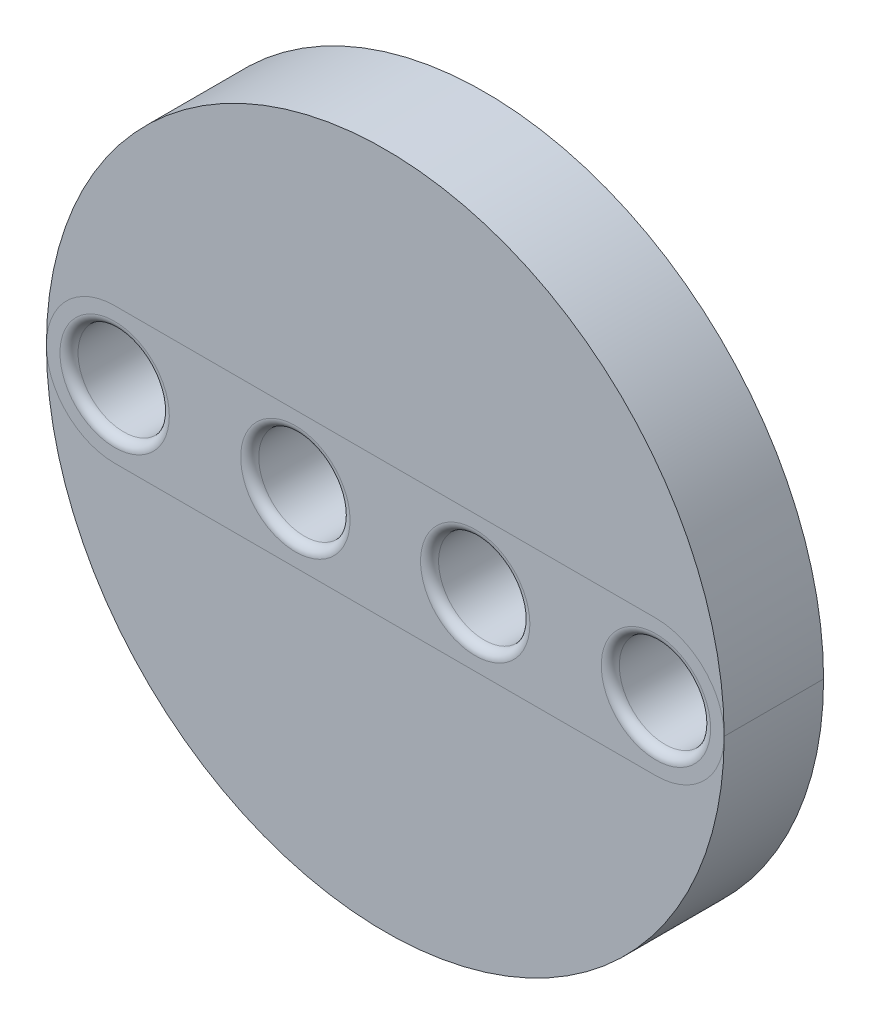
ISO-10303-21;
HEADER;
FILE_DESCRIPTION(('STEP AP214'),'2;1');
FILE_NAME('part.step','',(''),(''),'','','');
FILE_SCHEMA(('AUTOMOTIVE_DESIGN { 1 0 10303 214 1 1 1 1 }'));
ENDSEC;
DATA;
#1=APPLICATION_CONTEXT('core data for automotive mechanical design processes');
#2=APPLICATION_PROTOCOL_DEFINITION('international standard','automotive_design',2000,#1);
#3=PRODUCT_CONTEXT('',#1,'mechanical');
#4=PRODUCT('Part','Part','',(#3));
#5=PRODUCT_RELATED_PRODUCT_CATEGORY('part','',(#4));
#6=PRODUCT_DEFINITION_FORMATION('','',#4);
#7=PRODUCT_DEFINITION_CONTEXT('part definition',#1,'design');
#8=PRODUCT_DEFINITION('design','',#6,#7);
#9=PRODUCT_DEFINITION_SHAPE('','',#8);
#10=(LENGTH_UNIT() NAMED_UNIT(*) SI_UNIT(.MILLI.,.METRE.));
#11=(NAMED_UNIT(*) PLANE_ANGLE_UNIT() SI_UNIT($,.RADIAN.));
#12=(NAMED_UNIT(*) SI_UNIT($,.STERADIAN.) SOLID_ANGLE_UNIT());
#13=UNCERTAINTY_MEASURE_WITH_UNIT(LENGTH_MEASURE(1.E-05),#10,'distance_accuracy_value','');
#14=(GEOMETRIC_REPRESENTATION_CONTEXT(3) GLOBAL_UNCERTAINTY_ASSIGNED_CONTEXT((#13)) GLOBAL_UNIT_ASSIGNED_CONTEXT((#10,
#11,#12)) REPRESENTATION_CONTEXT('',''));
#15=CARTESIAN_POINT('',(0.,0.,0.));
#16=DIRECTION('',(0.,0.,1.));
#17=DIRECTION('',(1.,0.,0.));
#18=AXIS2_PLACEMENT_3D('',#15,#16,#17);
#19=CARTESIAN_POINT('',(59.9,0.,-83.8525491562421));
#20=DIRECTION('',(0.,0.,1.));
#21=DIRECTION('',(1.,0.,0.));
#22=AXIS2_PLACEMENT_3D('',#19,#20,#21);
#23=CYLINDRICAL_SURFACE('',#22,7.55);
#24=DIRECTION('',(0.,0.,1.));
#25=VECTOR('',#24,1.);
#26=CARTESIAN_POINT('',(59.9,7.55,-83.8525491562421));
#27=LINE('',#26,#25);
#28=CARTESIAN_POINT('',(59.9,7.55,0.));
#29=VERTEX_POINT('',#28);
#30=CARTESIAN_POINT('',(59.9,7.55,11.));
#31=VERTEX_POINT('',#30);
#32=EDGE_CURVE('E112',#29,#31,#27,.T.);
#33=ORIENTED_EDGE('',*,*,#32,.F.);
#34=CARTESIAN_POINT('',(59.9,0.,0.));
#35=DIRECTION('',(0.,0.,1.));
#36=DIRECTION('',(1.,0.,0.));
#37=AXIS2_PLACEMENT_3D('',#34,#35,#36);
#38=CIRCLE('',#37,7.55);
#39=CARTESIAN_POINT('',(67.45,0.,0.));
#40=VERTEX_POINT('',#39);
#41=EDGE_CURVE('E57',#29,#40,#38,.F.);
#42=ORIENTED_EDGE('',*,*,#41,.T.);
#43=DIRECTION('',(0.,0.,1.));
#44=VECTOR('',#43,1.);
#45=CARTESIAN_POINT('',(67.45,0.,-83.8525491562421));
#46=LINE('',#45,#44);
#47=CARTESIAN_POINT('',(67.45,0.,11.));
#48=VERTEX_POINT('',#47);
#49=EDGE_CURVE('E87',#40,#48,#46,.T.);
#50=ORIENTED_EDGE('',*,*,#49,.T.);
#51=CARTESIAN_POINT('',(59.9,0.,11.));
#52=DIRECTION('',(0.,0.,1.));
#53=DIRECTION('',(1.,0.,0.));
#54=AXIS2_PLACEMENT_3D('',#51,#52,#53);
#55=CIRCLE('',#54,7.55);
#56=EDGE_CURVE('E90',#48,#31,#55,.T.);
#57=ORIENTED_EDGE('',*,*,#56,.T.);
#58=EDGE_LOOP('',(#33,#42,#50,#57));
#59=FACE_BOUND('',#58,.T.);
#60=ADVANCED_FACE('F50',(#59),#23,.F.);
#61=CARTESIAN_POINT('',(0.,7.55,-83.8525491562421));
#62=DIRECTION('',(0.,1.,0.));
#63=DIRECTION('',(0.,0.,1.));
#64=AXIS2_PLACEMENT_3D('',#61,#62,#63);
#65=PLANE('',#64);
#66=DIRECTION('',(0.,0.,1.));
#67=VECTOR('',#66,1.);
#68=CARTESIAN_POINT('',(0.,7.55,-83.8525491562421));
#69=LINE('',#68,#67);
#70=CARTESIAN_POINT('',(0.,7.55,0.));
#71=VERTEX_POINT('',#70);
#72=CARTESIAN_POINT('',(0.,7.55,11.));
#73=VERTEX_POINT('',#72);
#74=EDGE_CURVE('E115',#71,#73,#69,.T.);
#75=ORIENTED_EDGE('',*,*,#74,.F.);
#76=DIRECTION('',(1.,0.,0.));
#77=VECTOR('',#76,1.);
#78=CARTESIAN_POINT('',(0.,7.55,0.));
#79=LINE('',#78,#77);
#80=EDGE_CURVE('E64',#71,#29,#79,.T.);
#81=ORIENTED_EDGE('',*,*,#80,.T.);
#82=ORIENTED_EDGE('',*,*,#32,.T.);
#83=DIRECTION('',(-1.,0.,0.));
#84=VECTOR('',#83,1.);
#85=CARTESIAN_POINT('',(0.,7.55,11.));
#86=LINE('',#85,#84);
#87=EDGE_CURVE('E94',#31,#73,#86,.T.);
#88=ORIENTED_EDGE('',*,*,#87,.T.);
#89=EDGE_LOOP('',(#75,#81,#82,#88));
#90=FACE_BOUND('',#89,.T.);
#91=ADVANCED_FACE('F121',(#90),#65,.F.);
#92=CARTESIAN_POINT('',(0.,0.,-83.8525491562421));
#93=DIRECTION('',(0.,0.,1.));
#94=DIRECTION('',(1.,0.,0.));
#95=AXIS2_PLACEMENT_3D('',#92,#93,#94);
#96=CYLINDRICAL_SURFACE('',#95,7.55);
#97=DIRECTION('',(0.,0.,1.));
#98=VECTOR('',#97,1.);
#99=CARTESIAN_POINT('',(-7.55,0.,-83.8525491562421));
#100=LINE('',#99,#98);
#101=CARTESIAN_POINT('',(-7.55,0.,0.));
#102=VERTEX_POINT('',#101);
#103=CARTESIAN_POINT('',(-7.55,0.,11.));
#104=VERTEX_POINT('',#103);
#105=EDGE_CURVE('E93',#102,#104,#100,.T.);
#106=ORIENTED_EDGE('',*,*,#105,.F.);
#107=CARTESIAN_POINT('',(0.,0.,0.));
#108=DIRECTION('',(0.,0.,1.));
#109=DIRECTION('',(1.,0.,0.));
#110=AXIS2_PLACEMENT_3D('',#107,#108,#109);
#111=CIRCLE('',#110,7.55);
#112=EDGE_CURVE('E114',#102,#71,#111,.F.);
#113=ORIENTED_EDGE('',*,*,#112,.T.);
#114=ORIENTED_EDGE('',*,*,#74,.T.);
#115=CARTESIAN_POINT('',(0.,0.,11.));
#116=DIRECTION('',(0.,0.,1.));
#117=DIRECTION('',(1.,0.,0.));
#118=AXIS2_PLACEMENT_3D('',#115,#116,#117);
#119=CIRCLE('',#118,7.55);
#120=EDGE_CURVE('E106',#73,#104,#119,.T.);
#121=ORIENTED_EDGE('',*,*,#120,.T.);
#122=EDGE_LOOP('',(#106,#113,#114,#121));
#123=FACE_BOUND('',#122,.T.);
#124=ADVANCED_FACE('F119',(#123),#96,.F.);
#125=CARTESIAN_POINT('',(29.95,0.,-83.8525491562421));
#126=DIRECTION('',(0.,0.,1.));
#127=DIRECTION('',(1.,0.,0.));
#128=AXIS2_PLACEMENT_3D('',#125,#126,#127);
#129=CYLINDRICAL_SURFACE('',#128,37.5);
#130=CARTESIAN_POINT('',(29.95,0.,0.));
#131=DIRECTION('',(0.,0.,1.));
#132=DIRECTION('',(1.,0.,0.));
#133=AXIS2_PLACEMENT_3D('',#130,#131,#132);
#134=CIRCLE('',#133,37.5);
#135=EDGE_CURVE('E12',#102,#40,#134,.F.);
#136=ORIENTED_EDGE('',*,*,#135,.F.);
#137=ORIENTED_EDGE('',*,*,#105,.T.);
#138=CARTESIAN_POINT('',(29.95,0.,11.));
#139=DIRECTION('',(0.,0.,1.));
#140=DIRECTION('',(1.,0.,0.));
#141=AXIS2_PLACEMENT_3D('',#138,#139,#140);
#142=CIRCLE('',#141,37.5);
#143=EDGE_CURVE('E100',#48,#104,#142,.T.);
#144=ORIENTED_EDGE('',*,*,#143,.F.);
#145=ORIENTED_EDGE('',*,*,#49,.F.);
#146=EDGE_LOOP('',(#136,#137,#144,#145));
#147=FACE_BOUND('',#146,.T.);
#148=ADVANCED_FACE('F103',(#147),#129,.T.);
#149=CARTESIAN_POINT('',(0.,0.,11.));
#150=DIRECTION('',(0.,0.,1.));
#151=DIRECTION('',(1.,0.,0.));
#152=AXIS2_PLACEMENT_3D('',#149,#150,#151);
#153=PLANE('',#152);
#154=ORIENTED_EDGE('',*,*,#56,.F.);
#155=ORIENTED_EDGE('',*,*,#143,.T.);
#156=ORIENTED_EDGE('',*,*,#120,.F.);
#157=ORIENTED_EDGE('',*,*,#87,.F.);
#158=EDGE_LOOP('',(#154,#155,#156,#157));
#159=FACE_BOUND('',#158,.T.);
#160=ADVANCED_FACE('F98',(#159),#153,.T.);
#161=CARTESIAN_POINT('',(0.,0.,0.));
#162=DIRECTION('',(0.,0.,1.));
#163=DIRECTION('',(1.,0.,0.));
#164=AXIS2_PLACEMENT_3D('',#161,#162,#163);
#165=PLANE('',#164);
#166=ORIENTED_EDGE('',*,*,#80,.F.);
#167=ORIENTED_EDGE('',*,*,#112,.F.);
#168=ORIENTED_EDGE('',*,*,#135,.T.);
#169=ORIENTED_EDGE('',*,*,#41,.F.);
#170=EDGE_LOOP('',(#166,#167,#168,#169));
#171=FACE_BOUND('',#170,.T.);
#172=ADVANCED_FACE('F137',(#171),#165,.F.);
#173=CLOSED_SHELL('',(#60,#91,#124,#148,#160,#172));
#174=MANIFOLD_SOLID_BREP('B2',#173);
#175=CARTESIAN_POINT('',(0.,0.,-83.8525491562421));
#176=DIRECTION('',(0.,0.,1.));
#177=DIRECTION('',(1.,0.,0.));
#178=AXIS2_PLACEMENT_3D('',#175,#176,#177);
#179=CYLINDRICAL_SURFACE('',#178,7.55);
#180=DIRECTION('',(0.,0.,1.));
#181=VECTOR('',#180,1.);
#182=CARTESIAN_POINT('',(0.,-7.55,-83.8525491562421));
#183=LINE('',#182,#181);
#184=CARTESIAN_POINT('',(0.,-7.55,0.));
#185=VERTEX_POINT('',#184);
#186=CARTESIAN_POINT('',(0.,-7.55,11.));
#187=VERTEX_POINT('',#186);
#188=EDGE_CURVE('E257',#185,#187,#183,.T.);
#189=ORIENTED_EDGE('',*,*,#188,.F.);
#190=CARTESIAN_POINT('',(0.,0.,0.));
#191=DIRECTION('',(0.,0.,1.));
#192=DIRECTION('',(1.,0.,0.));
#193=AXIS2_PLACEMENT_3D('',#190,#191,#192);
#194=CIRCLE('',#193,7.55);
#195=CARTESIAN_POINT('',(-7.55000000000001,0.,0.));
#196=VERTEX_POINT('',#195);
#197=EDGE_CURVE('E202',#185,#196,#194,.F.);
#198=ORIENTED_EDGE('',*,*,#197,.T.);
#199=DIRECTION('',(0.,0.,1.));
#200=VECTOR('',#199,1.);
#201=CARTESIAN_POINT('',(-7.55,0.,-83.8525491562421));
#202=LINE('',#201,#200);
#203=CARTESIAN_POINT('',(-7.55,0.,11.));
#204=VERTEX_POINT('',#203);
#205=EDGE_CURVE('E232',#196,#204,#202,.T.);
#206=ORIENTED_EDGE('',*,*,#205,.T.);
#207=CARTESIAN_POINT('',(0.,0.,11.));
#208=DIRECTION('',(0.,0.,1.));
#209=DIRECTION('',(1.,0.,0.));
#210=AXIS2_PLACEMENT_3D('',#207,#208,#209);
#211=CIRCLE('',#210,7.55);
#212=EDGE_CURVE('E235',#204,#187,#211,.T.);
#213=ORIENTED_EDGE('',*,*,#212,.T.);
#214=EDGE_LOOP('',(#189,#198,#206,#213));
#215=FACE_BOUND('',#214,.T.);
#216=ADVANCED_FACE('F195',(#215),#179,.F.);
#217=CARTESIAN_POINT('',(0.,-7.55,-83.8525491562421));
#218=DIRECTION('',(0.,-1.,0.));
#219=DIRECTION('',(0.,0.,-1.));
#220=AXIS2_PLACEMENT_3D('',#217,#218,#219);
#221=PLANE('',#220);
#222=DIRECTION('',(0.,0.,1.));
#223=VECTOR('',#222,1.);
#224=CARTESIAN_POINT('',(59.9,-7.55,-83.8525491562421));
#225=LINE('',#224,#223);
#226=CARTESIAN_POINT('',(59.9,-7.55,0.));
#227=VERTEX_POINT('',#226);
#228=CARTESIAN_POINT('',(59.9,-7.55,11.));
#229=VERTEX_POINT('',#228);
#230=EDGE_CURVE('E260',#227,#229,#225,.T.);
#231=ORIENTED_EDGE('',*,*,#230,.F.);
#232=DIRECTION('',(-1.,0.,0.));
#233=VECTOR('',#232,1.);
#234=CARTESIAN_POINT('',(0.,-7.55,0.));
#235=LINE('',#234,#233);
#236=EDGE_CURVE('E209',#227,#185,#235,.T.);
#237=ORIENTED_EDGE('',*,*,#236,.T.);
#238=ORIENTED_EDGE('',*,*,#188,.T.);
#239=DIRECTION('',(1.,0.,0.));
#240=VECTOR('',#239,1.);
#241=CARTESIAN_POINT('',(0.,-7.55,11.));
#242=LINE('',#241,#240);
#243=EDGE_CURVE('E239',#187,#229,#242,.T.);
#244=ORIENTED_EDGE('',*,*,#243,.T.);
#245=EDGE_LOOP('',(#231,#237,#238,#244));
#246=FACE_BOUND('',#245,.T.);
#247=ADVANCED_FACE('F266',(#246),#221,.F.);
#248=CARTESIAN_POINT('',(59.9,0.,-83.8525491562421));
#249=DIRECTION('',(0.,0.,1.));
#250=DIRECTION('',(1.,0.,0.));
#251=AXIS2_PLACEMENT_3D('',#248,#249,#250);
#252=CYLINDRICAL_SURFACE('',#251,7.55);
#253=DIRECTION('',(0.,0.,1.));
#254=VECTOR('',#253,1.);
#255=CARTESIAN_POINT('',(67.45,0.,-83.8525491562421));
#256=LINE('',#255,#254);
#257=CARTESIAN_POINT('',(67.45,0.,0.));
#258=VERTEX_POINT('',#257);
#259=CARTESIAN_POINT('',(67.45,0.,11.));
#260=VERTEX_POINT('',#259);
#261=EDGE_CURVE('E238',#258,#260,#256,.T.);
#262=ORIENTED_EDGE('',*,*,#261,.F.);
#263=CARTESIAN_POINT('',(59.9,0.,0.));
#264=DIRECTION('',(0.,0.,1.));
#265=DIRECTION('',(1.,0.,0.));
#266=AXIS2_PLACEMENT_3D('',#263,#264,#265);
#267=CIRCLE('',#266,7.55);
#268=EDGE_CURVE('E259',#258,#227,#267,.F.);
#269=ORIENTED_EDGE('',*,*,#268,.T.);
#270=ORIENTED_EDGE('',*,*,#230,.T.);
#271=CARTESIAN_POINT('',(59.9,0.,11.));
#272=DIRECTION('',(0.,0.,1.));
#273=DIRECTION('',(1.,0.,0.));
#274=AXIS2_PLACEMENT_3D('',#271,#272,#273);
#275=CIRCLE('',#274,7.55);
#276=EDGE_CURVE('E251',#229,#260,#275,.T.);
#277=ORIENTED_EDGE('',*,*,#276,.T.);
#278=EDGE_LOOP('',(#262,#269,#270,#277));
#279=FACE_BOUND('',#278,.T.);
#280=ADVANCED_FACE('F264',(#279),#252,.F.);
#281=CARTESIAN_POINT('',(29.95,0.,-83.8525491562421));
#282=DIRECTION('',(0.,0.,1.));
#283=DIRECTION('',(1.,0.,0.));
#284=AXIS2_PLACEMENT_3D('',#281,#282,#283);
#285=CYLINDRICAL_SURFACE('',#284,37.5);
#286=CARTESIAN_POINT('',(29.95,0.,0.));
#287=DIRECTION('',(0.,0.,1.));
#288=DIRECTION('',(1.,0.,0.));
#289=AXIS2_PLACEMENT_3D('',#286,#287,#288);
#290=CIRCLE('',#289,37.5);
#291=EDGE_CURVE('E48',#258,#196,#290,.F.);
#292=ORIENTED_EDGE('',*,*,#291,.F.);
#293=ORIENTED_EDGE('',*,*,#261,.T.);
#294=CARTESIAN_POINT('',(29.95,0.,11.));
#295=DIRECTION('',(0.,0.,1.));
#296=DIRECTION('',(1.,0.,0.));
#297=AXIS2_PLACEMENT_3D('',#294,#295,#296);
#298=CIRCLE('',#297,37.5);
#299=EDGE_CURVE('E245',#204,#260,#298,.T.);
#300=ORIENTED_EDGE('',*,*,#299,.F.);
#301=ORIENTED_EDGE('',*,*,#205,.F.);
#302=EDGE_LOOP('',(#292,#293,#300,#301));
#303=FACE_BOUND('',#302,.T.);
#304=ADVANCED_FACE('F248',(#303),#285,.T.);
#305=CARTESIAN_POINT('',(0.,0.,11.));
#306=DIRECTION('',(0.,0.,1.));
#307=DIRECTION('',(1.,0.,0.));
#308=AXIS2_PLACEMENT_3D('',#305,#306,#307);
#309=PLANE('',#308);
#310=ORIENTED_EDGE('',*,*,#212,.F.);
#311=ORIENTED_EDGE('',*,*,#299,.T.);
#312=ORIENTED_EDGE('',*,*,#276,.F.);
#313=ORIENTED_EDGE('',*,*,#243,.F.);
#314=EDGE_LOOP('',(#310,#311,#312,#313));
#315=FACE_BOUND('',#314,.T.);
#316=ADVANCED_FACE('F243',(#315),#309,.T.);
#317=CARTESIAN_POINT('',(0.,0.,0.));
#318=DIRECTION('',(0.,0.,1.));
#319=DIRECTION('',(1.,0.,0.));
#320=AXIS2_PLACEMENT_3D('',#317,#318,#319);
#321=PLANE('',#320);
#322=ORIENTED_EDGE('',*,*,#236,.F.);
#323=ORIENTED_EDGE('',*,*,#268,.F.);
#324=ORIENTED_EDGE('',*,*,#291,.T.);
#325=ORIENTED_EDGE('',*,*,#197,.F.);
#326=EDGE_LOOP('',(#322,#323,#324,#325));
#327=FACE_BOUND('',#326,.T.);
#328=ADVANCED_FACE('F282',(#327),#321,.F.);
#329=CLOSED_SHELL('',(#216,#247,#280,#304,#316,#328));
#330=MANIFOLD_SOLID_BREP('B6',#329);
#331=CARTESIAN_POINT('',(29.95,0.,11.));
#332=DIRECTION('',(0.,0.,-1.));
#333=DIRECTION('',(-1.,0.,0.));
#334=AXIS2_PLACEMENT_3D('',#331,#332,#333);
#335=CYLINDRICAL_SURFACE('',#334,2.55000000000001);
#336=CARTESIAN_POINT('',(29.95,0.,1.));
#337=DIRECTION('',(0.,0.,1.));
#338=DIRECTION('',(1.,0.,0.));
#339=AXIS2_PLACEMENT_3D('',#336,#337,#338);
#340=CIRCLE('',#339,2.55000000000001);
#341=CARTESIAN_POINT('',(32.5,0.,1.));
#342=VERTEX_POINT('',#341);
#343=EDGE_CURVE('E444',#342,#342,#340,.F.);
#344=ORIENTED_EDGE('',*,*,#343,.T.);
#345=EDGE_LOOP('',(#344));
#346=FACE_BOUND('',#345,.T.);
#347=CARTESIAN_POINT('',(29.95,0.,10.));
#348=DIRECTION('',(0.,0.,1.));
#349=DIRECTION('',(1.,0.,0.));
#350=AXIS2_PLACEMENT_3D('',#347,#348,#349);
#351=CIRCLE('',#350,2.55000000000001);
#352=CARTESIAN_POINT('',(32.5,0.,10.));
#353=VERTEX_POINT('',#352);
#354=EDGE_CURVE('E527',#353,#353,#351,.T.);
#355=ORIENTED_EDGE('',*,*,#354,.T.);
#356=EDGE_LOOP('',(#355));
#357=FACE_BOUND('',#356,.T.);
#358=ADVANCED_FACE('F331',(#346,#357),#335,.F.);
#359=CARTESIAN_POINT('',(0.,0.,11.));
#360=DIRECTION('',(0.,0.,-1.));
#361=DIRECTION('',(-1.,0.,0.));
#362=AXIS2_PLACEMENT_3D('',#359,#360,#361);
#363=CYLINDRICAL_SURFACE('',#362,2.55);
#364=CARTESIAN_POINT('',(0.,0.,0.));
#365=DIRECTION('',(0.,0.,1.));
#366=DIRECTION('',(1.,0.,0.));
#367=AXIS2_PLACEMENT_3D('',#364,#365,#366);
#368=CIRCLE('',#367,2.55);
#369=CARTESIAN_POINT('',(2.55,0.,0.));
#370=VERTEX_POINT('',#369);
#371=EDGE_CURVE('E402',#370,#370,#368,.T.);
#372=ORIENTED_EDGE('',*,*,#371,.F.);
#373=EDGE_LOOP('',(#372));
#374=FACE_BOUND('',#373,.T.);
#375=CARTESIAN_POINT('',(0.,0.,0.999999999999999));
#376=DIRECTION('',(0.,0.,1.));
#377=DIRECTION('',(1.,0.,0.));
#378=AXIS2_PLACEMENT_3D('',#375,#376,#377);
#379=CIRCLE('',#378,2.55);
#380=CARTESIAN_POINT('',(2.55,0.,0.999999999999999));
#381=VERTEX_POINT('',#380);
#382=EDGE_CURVE('E420',#381,#381,#379,.T.);
#383=ORIENTED_EDGE('',*,*,#382,.T.);
#384=EDGE_LOOP('',(#383));
#385=FACE_BOUND('',#384,.T.);
#386=ADVANCED_FACE('F466',(#374,#385),#363,.F.);
#387=CARTESIAN_POINT('',(59.9,0.,11.));
#388=DIRECTION('',(0.,0.,-1.));
#389=DIRECTION('',(-1.,0.,0.));
#390=AXIS2_PLACEMENT_3D('',#387,#388,#389);
#391=CYLINDRICAL_SURFACE('',#390,2.55);
#392=CARTESIAN_POINT('',(59.9,0.,0.));
#393=DIRECTION('',(0.,0.,1.));
#394=DIRECTION('',(1.,0.,0.));
#395=AXIS2_PLACEMENT_3D('',#392,#393,#394);
#396=CIRCLE('',#395,2.55);
#397=CARTESIAN_POINT('',(62.45,0.,0.));
#398=VERTEX_POINT('',#397);
#399=EDGE_CURVE('E535',#398,#398,#396,.T.);
#400=ORIENTED_EDGE('',*,*,#399,.F.);
#401=EDGE_LOOP('',(#400));
#402=FACE_BOUND('',#401,.T.);
#403=CARTESIAN_POINT('',(59.9,0.,0.999999999999999));
#404=DIRECTION('',(0.,0.,1.));
#405=DIRECTION('',(1.,0.,0.));
#406=AXIS2_PLACEMENT_3D('',#403,#404,#405);
#407=CIRCLE('',#406,2.55);
#408=CARTESIAN_POINT('',(62.45,0.,0.999999999999999));
#409=VERTEX_POINT('',#408);
#410=EDGE_CURVE('E417',#409,#409,#407,.T.);
#411=ORIENTED_EDGE('',*,*,#410,.T.);
#412=EDGE_LOOP('',(#411));
#413=FACE_BOUND('',#412,.T.);
#414=ADVANCED_FACE('F472',(#402,#413),#391,.F.);
#415=CARTESIAN_POINT('',(20.,0.,11.));
#416=DIRECTION('',(0.,0.,-1.));
#417=DIRECTION('',(-1.,0.,0.));
#418=AXIS2_PLACEMENT_3D('',#415,#416,#417);
#419=CYLINDRICAL_SURFACE('',#418,2.55);
#420=CARTESIAN_POINT('',(20.,0.,0.));
#421=DIRECTION('',(0.,0.,1.));
#422=DIRECTION('',(1.,0.,0.));
#423=AXIS2_PLACEMENT_3D('',#420,#421,#422);
#424=CIRCLE('',#423,2.55);
#425=CARTESIAN_POINT('',(22.55,0.,0.));
#426=VERTEX_POINT('',#425);
#427=EDGE_CURVE('E532',#426,#426,#424,.T.);
#428=ORIENTED_EDGE('',*,*,#427,.F.);
#429=EDGE_LOOP('',(#428));
#430=FACE_BOUND('',#429,.T.);
#431=CARTESIAN_POINT('',(20.,0.,0.999999999999999));
#432=DIRECTION('',(0.,0.,1.));
#433=DIRECTION('',(1.,0.,0.));
#434=AXIS2_PLACEMENT_3D('',#431,#432,#433);
#435=CIRCLE('',#434,2.55);
#436=CARTESIAN_POINT('',(22.55,0.,0.999999999999999));
#437=VERTEX_POINT('',#436);
#438=EDGE_CURVE('E413',#437,#437,#435,.T.);
#439=ORIENTED_EDGE('',*,*,#438,.T.);
#440=EDGE_LOOP('',(#439));
#441=FACE_BOUND('',#440,.T.);
#442=ADVANCED_FACE('F583',(#430,#441),#419,.F.);
#443=CARTESIAN_POINT('',(39.9,0.,11.));
#444=DIRECTION('',(0.,0.,-1.));
#445=DIRECTION('',(-1.,0.,0.));
#446=AXIS2_PLACEMENT_3D('',#443,#444,#445);
#447=CYLINDRICAL_SURFACE('',#446,2.55);
#448=CARTESIAN_POINT('',(39.9,0.,0.));
#449=DIRECTION('',(0.,0.,1.));
#450=DIRECTION('',(1.,0.,0.));
#451=AXIS2_PLACEMENT_3D('',#448,#449,#450);
#452=CIRCLE('',#451,2.55);
#453=CARTESIAN_POINT('',(42.45,0.,0.));
#454=VERTEX_POINT('',#453);
#455=EDGE_CURVE('E423',#454,#454,#452,.T.);
#456=ORIENTED_EDGE('',*,*,#455,.F.);
#457=EDGE_LOOP('',(#456));
#458=FACE_BOUND('',#457,.T.);
#459=CARTESIAN_POINT('',(39.9,0.,0.999999999999999));
#460=DIRECTION('',(0.,0.,1.));
#461=DIRECTION('',(1.,0.,0.));
#462=AXIS2_PLACEMENT_3D('',#459,#460,#461);
#463=CIRCLE('',#462,2.55);
#464=CARTESIAN_POINT('',(42.45,0.,0.999999999999999));
#465=VERTEX_POINT('',#464);
#466=EDGE_CURVE('E410',#465,#465,#463,.T.);
#467=ORIENTED_EDGE('',*,*,#466,.T.);
#468=EDGE_LOOP('',(#467));
#469=FACE_BOUND('',#468,.T.);
#470=ADVANCED_FACE('F481',(#458,#469),#447,.F.);
#471=CARTESIAN_POINT('',(0.,0.,11.));
#472=DIRECTION('',(0.,0.,1.));
#473=DIRECTION('',(1.,0.,0.));
#474=AXIS2_PLACEMENT_3D('',#471,#472,#473);
#475=PLANE('',#474);
#476=CARTESIAN_POINT('',(39.9,0.,11.));
#477=DIRECTION('',(0.,0.,1.));
#478=DIRECTION('',(1.,0.,0.));
#479=AXIS2_PLACEMENT_3D('',#476,#477,#478);
#480=CIRCLE('',#479,6.05);
#481=CARTESIAN_POINT('',(45.95,0.,11.));
#482=VERTEX_POINT('',#481);
#483=EDGE_CURVE('E435',#482,#482,#480,.F.);
#484=ORIENTED_EDGE('',*,*,#483,.T.);
#485=EDGE_LOOP('',(#484));
#486=FACE_BOUND('',#485,.T.);
#487=CARTESIAN_POINT('',(20.,0.,11.));
#488=DIRECTION('',(0.,0.,1.));
#489=DIRECTION('',(1.,0.,0.));
#490=AXIS2_PLACEMENT_3D('',#487,#488,#489);
#491=CIRCLE('',#490,6.05);
#492=CARTESIAN_POINT('',(26.05,0.,11.));
#493=VERTEX_POINT('',#492);
#494=EDGE_CURVE('E432',#493,#493,#491,.F.);
#495=ORIENTED_EDGE('',*,*,#494,.T.);
#496=EDGE_LOOP('',(#495));
#497=FACE_BOUND('',#496,.T.);
#498=CARTESIAN_POINT('',(59.9,0.,11.));
#499=DIRECTION('',(0.,0.,1.));
#500=DIRECTION('',(1.,0.,0.));
#501=AXIS2_PLACEMENT_3D('',#498,#499,#500);
#502=CIRCLE('',#501,6.05);
#503=CARTESIAN_POINT('',(65.95,0.,11.));
#504=VERTEX_POINT('',#503);
#505=EDGE_CURVE('E429',#504,#504,#502,.F.);
#506=ORIENTED_EDGE('',*,*,#505,.T.);
#507=EDGE_LOOP('',(#506));
#508=FACE_BOUND('',#507,.T.);
#509=CARTESIAN_POINT('',(0.,0.,11.));
#510=DIRECTION('',(0.,0.,1.));
#511=DIRECTION('',(1.,0.,0.));
#512=AXIS2_PLACEMENT_3D('',#509,#510,#511);
#513=CIRCLE('',#512,6.05);
#514=CARTESIAN_POINT('',(6.05,0.,11.));
#515=VERTEX_POINT('',#514);
#516=EDGE_CURVE('E426',#515,#515,#513,.F.);
#517=ORIENTED_EDGE('',*,*,#516,.T.);
#518=EDGE_LOOP('',(#517));
#519=FACE_BOUND('',#518,.T.);
#520=CARTESIAN_POINT('',(0.,0.,11.));
#521=DIRECTION('',(0.,0.,1.));
#522=DIRECTION('',(1.,0.,0.));
#523=AXIS2_PLACEMENT_3D('',#520,#521,#522);
#524=CIRCLE('',#523,7.55);
#525=CARTESIAN_POINT('',(0.,7.55,11.));
#526=VERTEX_POINT('',#525);
#527=CARTESIAN_POINT('',(0.,-7.55,11.));
#528=VERTEX_POINT('',#527);
#529=EDGE_CURVE('E384',#526,#528,#524,.T.);
#530=ORIENTED_EDGE('',*,*,#529,.T.);
#531=DIRECTION('',(1.,0.,0.));
#532=VECTOR('',#531,1.);
#533=CARTESIAN_POINT('',(0.,-7.55,11.));
#534=LINE('',#533,#532);
#535=CARTESIAN_POINT('',(59.9,-7.55,11.));
#536=VERTEX_POINT('',#535);
#537=EDGE_CURVE('E379',#528,#536,#534,.T.);
#538=ORIENTED_EDGE('',*,*,#537,.T.);
#539=CARTESIAN_POINT('',(59.9,0.,11.));
#540=DIRECTION('',(0.,0.,1.));
#541=DIRECTION('',(1.,0.,0.));
#542=AXIS2_PLACEMENT_3D('',#539,#540,#541);
#543=CIRCLE('',#542,7.55);
#544=CARTESIAN_POINT('',(59.9,7.55,11.));
#545=VERTEX_POINT('',#544);
#546=EDGE_CURVE('E382',#536,#545,#543,.T.);
#547=ORIENTED_EDGE('',*,*,#546,.T.);
#548=DIRECTION('',(-1.,0.,0.));
#549=VECTOR('',#548,1.);
#550=CARTESIAN_POINT('',(0.,7.55,11.));
#551=LINE('',#550,#549);
#552=EDGE_CURVE('E348',#545,#526,#551,.T.);
#553=ORIENTED_EDGE('',*,*,#552,.T.);
#554=EDGE_LOOP('',(#530,#538,#547,#553));
#555=FACE_BOUND('',#554,.T.);
#556=ADVANCED_FACE('F380',(#486,#497,#508,#519,#555),#475,.T.);
#557=CARTESIAN_POINT('',(0.,0.,0.));
#558=DIRECTION('',(0.,0.,1.));
#559=DIRECTION('',(1.,0.,0.));
#560=AXIS2_PLACEMENT_3D('',#557,#558,#559);
#561=PLANE('',#560);
#562=CARTESIAN_POINT('',(29.95,0.,0.));
#563=DIRECTION('',(0.,0.,1.));
#564=DIRECTION('',(1.,0.,0.));
#565=AXIS2_PLACEMENT_3D('',#562,#563,#564);
#566=CIRCLE('',#565,3.55000000000001);
#567=CARTESIAN_POINT('',(33.5,0.,0.));
#568=VERTEX_POINT('',#567);
#569=EDGE_CURVE('E441',#568,#568,#566,.T.);
#570=ORIENTED_EDGE('',*,*,#569,.T.);
#571=EDGE_LOOP('',(#570));
#572=FACE_BOUND('',#571,.T.);
#573=CARTESIAN_POINT('',(0.,0.,0.));
#574=DIRECTION('',(0.,0.,1.));
#575=DIRECTION('',(1.,0.,0.));
#576=AXIS2_PLACEMENT_3D('',#573,#574,#575);
#577=CIRCLE('',#576,7.55);
#578=CARTESIAN_POINT('',(0.,7.55,0.));
#579=VERTEX_POINT('',#578);
#580=CARTESIAN_POINT('',(0.,-7.55,0.));
#581=VERTEX_POINT('',#580);
#582=EDGE_CURVE('E399',#579,#581,#577,.T.);
#583=ORIENTED_EDGE('',*,*,#582,.F.);
#584=DIRECTION('',(-1.,0.,0.));
#585=VECTOR('',#584,1.);
#586=CARTESIAN_POINT('',(0.,7.55,0.));
#587=LINE('',#586,#585);
#588=CARTESIAN_POINT('',(59.9,7.55,0.));
#589=VERTEX_POINT('',#588);
#590=EDGE_CURVE('E371',#589,#579,#587,.T.);
#591=ORIENTED_EDGE('',*,*,#590,.F.);
#592=CARTESIAN_POINT('',(59.9,0.,0.));
#593=DIRECTION('',(0.,0.,1.));
#594=DIRECTION('',(1.,0.,0.));
#595=AXIS2_PLACEMENT_3D('',#592,#593,#594);
#596=CIRCLE('',#595,7.55);
#597=CARTESIAN_POINT('',(59.9,-7.55,0.));
#598=VERTEX_POINT('',#597);
#599=EDGE_CURVE('E365',#598,#589,#596,.T.);
#600=ORIENTED_EDGE('',*,*,#599,.F.);
#601=DIRECTION('',(1.,0.,0.));
#602=VECTOR('',#601,1.);
#603=CARTESIAN_POINT('',(0.,-7.55,0.));
#604=LINE('',#603,#602);
#605=EDGE_CURVE('E389',#581,#598,#604,.T.);
#606=ORIENTED_EDGE('',*,*,#605,.F.);
#607=EDGE_LOOP('',(#583,#591,#600,#606));
#608=FACE_BOUND('',#607,.T.);
#609=ORIENTED_EDGE('',*,*,#371,.T.);
#610=EDGE_LOOP('',(#609));
#611=FACE_BOUND('',#610,.T.);
#612=ORIENTED_EDGE('',*,*,#399,.T.);
#613=EDGE_LOOP('',(#612));
#614=FACE_BOUND('',#613,.T.);
#615=ORIENTED_EDGE('',*,*,#427,.T.);
#616=EDGE_LOOP('',(#615));
#617=FACE_BOUND('',#616,.T.);
#618=ORIENTED_EDGE('',*,*,#455,.T.);
#619=EDGE_LOOP('',(#618));
#620=FACE_BOUND('',#619,.T.);
#621=ADVANCED_FACE('F480',(#572,#608,#611,#614,#617,#620),#561,.F.);
#622=CARTESIAN_POINT('',(0.,0.,11.));
#623=DIRECTION('',(0.,0.,-1.));
#624=DIRECTION('',(-1.,0.,0.));
#625=AXIS2_PLACEMENT_3D('',#622,#623,#624);
#626=CYLINDRICAL_SURFACE('',#625,7.55);
#627=ORIENTED_EDGE('',*,*,#582,.T.);
#628=DIRECTION('',(0.,0.,-1.));
#629=VECTOR('',#628,1.);
#630=CARTESIAN_POINT('',(0.,-7.55,11.));
#631=LINE('',#630,#629);
#632=EDGE_CURVE('E390',#528,#581,#631,.T.);
#633=ORIENTED_EDGE('',*,*,#632,.F.);
#634=ORIENTED_EDGE('',*,*,#529,.F.);
#635=DIRECTION('',(0.,0.,-1.));
#636=VECTOR('',#635,1.);
#637=CARTESIAN_POINT('',(0.,7.55,11.));
#638=LINE('',#637,#636);
#639=EDGE_CURVE('E395',#526,#579,#638,.T.);
#640=ORIENTED_EDGE('',*,*,#639,.T.);
#641=EDGE_LOOP('',(#627,#633,#634,#640));
#642=FACE_BOUND('',#641,.T.);
#643=ADVANCED_FACE('F485',(#642),#626,.T.);
#644=CARTESIAN_POINT('',(0.,-7.55,11.));
#645=DIRECTION('',(0.,1.,0.));
#646=DIRECTION('',(0.,0.,1.));
#647=AXIS2_PLACEMENT_3D('',#644,#645,#646);
#648=PLANE('',#647);
#649=ORIENTED_EDGE('',*,*,#605,.T.);
#650=DIRECTION('',(0.,0.,-1.));
#651=VECTOR('',#650,1.);
#652=CARTESIAN_POINT('',(59.9,-7.55,11.));
#653=LINE('',#652,#651);
#654=EDGE_CURVE('E387',#536,#598,#653,.T.);
#655=ORIENTED_EDGE('',*,*,#654,.F.);
#656=ORIENTED_EDGE('',*,*,#537,.F.);
#657=ORIENTED_EDGE('',*,*,#632,.T.);
#658=EDGE_LOOP('',(#649,#655,#656,#657));
#659=FACE_BOUND('',#658,.T.);
#660=ADVANCED_FACE('F388',(#659),#648,.F.);
#661=CARTESIAN_POINT('',(59.9,0.,11.));
#662=DIRECTION('',(0.,0.,-1.));
#663=DIRECTION('',(-1.,0.,0.));
#664=AXIS2_PLACEMENT_3D('',#661,#662,#663);
#665=CYLINDRICAL_SURFACE('',#664,7.55);
#666=ORIENTED_EDGE('',*,*,#599,.T.);
#667=DIRECTION('',(0.,0.,-1.));
#668=VECTOR('',#667,1.);
#669=CARTESIAN_POINT('',(59.9,7.55,11.));
#670=LINE('',#669,#668);
#671=EDGE_CURVE('E391',#545,#589,#670,.T.);
#672=ORIENTED_EDGE('',*,*,#671,.F.);
#673=ORIENTED_EDGE('',*,*,#546,.F.);
#674=ORIENTED_EDGE('',*,*,#654,.T.);
#675=EDGE_LOOP('',(#666,#672,#673,#674));
#676=FACE_BOUND('',#675,.T.);
#677=ADVANCED_FACE('F393',(#676),#665,.T.);
#678=CARTESIAN_POINT('',(0.,7.55,11.));
#679=DIRECTION('',(0.,-1.,0.));
#680=DIRECTION('',(0.,0.,-1.));
#681=AXIS2_PLACEMENT_3D('',#678,#679,#680);
#682=PLANE('',#681);
#683=ORIENTED_EDGE('',*,*,#590,.T.);
#684=ORIENTED_EDGE('',*,*,#639,.F.);
#685=ORIENTED_EDGE('',*,*,#552,.F.);
#686=ORIENTED_EDGE('',*,*,#671,.T.);
#687=EDGE_LOOP('',(#683,#684,#685,#686));
#688=FACE_BOUND('',#687,.T.);
#689=ADVANCED_FACE('F487',(#688),#682,.F.);
#690=CARTESIAN_POINT('',(39.9,0.,0.999999999999999));
#691=DIRECTION('',(0.,0.,1.));
#692=DIRECTION('',(1.,0.,0.));
#693=AXIS2_PLACEMENT_3D('',#690,#691,#692);
#694=CYLINDRICAL_SURFACE('',#693,5.05);
#695=CARTESIAN_POINT('',(39.9,0.,10.));
#696=DIRECTION('',(0.,0.,1.));
#697=DIRECTION('',(1.,0.,0.));
#698=AXIS2_PLACEMENT_3D('',#695,#696,#697);
#699=CIRCLE('',#698,5.05);
#700=CARTESIAN_POINT('',(44.95,0.,10.));
#701=VERTEX_POINT('',#700);
#702=EDGE_CURVE('E409',#701,#701,#699,.T.);
#703=ORIENTED_EDGE('',*,*,#702,.T.);
#704=EDGE_LOOP('',(#703));
#705=FACE_BOUND('',#704,.T.);
#706=CARTESIAN_POINT('',(39.9,0.,0.999999999999999));
#707=DIRECTION('',(0.,0.,1.));
#708=DIRECTION('',(1.,0.,0.));
#709=AXIS2_PLACEMENT_3D('',#706,#707,#708);
#710=CIRCLE('',#709,5.05);
#711=CARTESIAN_POINT('',(44.95,0.,0.999999999999999));
#712=VERTEX_POINT('',#711);
#713=EDGE_CURVE('E522',#712,#712,#710,.T.);
#714=ORIENTED_EDGE('',*,*,#713,.F.);
#715=EDGE_LOOP('',(#714));
#716=FACE_BOUND('',#715,.T.);
#717=ADVANCED_FACE('F490',(#705,#716),#694,.F.);
#718=CARTESIAN_POINT('',(39.9,0.,0.999999999999999));
#719=DIRECTION('',(0.,0.,1.));
#720=DIRECTION('',(1.,0.,0.));
#721=AXIS2_PLACEMENT_3D('',#718,#719,#720);
#722=PLANE('',#721);
#723=ORIENTED_EDGE('',*,*,#466,.F.);
#724=EDGE_LOOP('',(#723));
#725=FACE_BOUND('',#724,.T.);
#726=ORIENTED_EDGE('',*,*,#713,.T.);
#727=EDGE_LOOP('',(#726));
#728=FACE_BOUND('',#727,.T.);
#729=ADVANCED_FACE('F515',(#725,#728),#722,.T.);
#730=CARTESIAN_POINT('',(20.,0.,0.999999999999999));
#731=DIRECTION('',(0.,0.,1.));
#732=DIRECTION('',(1.,0.,0.));
#733=AXIS2_PLACEMENT_3D('',#730,#731,#732);
#734=CYLINDRICAL_SURFACE('',#733,5.05);
#735=CARTESIAN_POINT('',(20.,0.,10.));
#736=DIRECTION('',(0.,0.,1.));
#737=DIRECTION('',(1.,0.,0.));
#738=AXIS2_PLACEMENT_3D('',#735,#736,#737);
#739=CIRCLE('',#738,5.05);
#740=CARTESIAN_POINT('',(25.05,0.,10.));
#741=VERTEX_POINT('',#740);
#742=EDGE_CURVE('E438',#741,#741,#739,.T.);
#743=ORIENTED_EDGE('',*,*,#742,.T.);
#744=EDGE_LOOP('',(#743));
#745=FACE_BOUND('',#744,.T.);
#746=CARTESIAN_POINT('',(20.,0.,0.999999999999999));
#747=DIRECTION('',(0.,0.,1.));
#748=DIRECTION('',(1.,0.,0.));
#749=AXIS2_PLACEMENT_3D('',#746,#747,#748);
#750=CIRCLE('',#749,5.05);
#751=CARTESIAN_POINT('',(25.05,0.,0.999999999999999));
#752=VERTEX_POINT('',#751);
#753=EDGE_CURVE('E519',#752,#752,#750,.T.);
#754=ORIENTED_EDGE('',*,*,#753,.F.);
#755=EDGE_LOOP('',(#754));
#756=FACE_BOUND('',#755,.T.);
#757=ADVANCED_FACE('F511',(#745,#756),#734,.F.);
#758=CARTESIAN_POINT('',(20.,0.,0.999999999999999));
#759=DIRECTION('',(0.,0.,1.));
#760=DIRECTION('',(1.,0.,0.));
#761=AXIS2_PLACEMENT_3D('',#758,#759,#760);
#762=PLANE('',#761);
#763=ORIENTED_EDGE('',*,*,#438,.F.);
#764=EDGE_LOOP('',(#763));
#765=FACE_BOUND('',#764,.T.);
#766=ORIENTED_EDGE('',*,*,#753,.T.);
#767=EDGE_LOOP('',(#766));
#768=FACE_BOUND('',#767,.T.);
#769=ADVANCED_FACE('F514',(#765,#768),#762,.T.);
#770=CARTESIAN_POINT('',(59.9,0.,0.999999999999999));
#771=DIRECTION('',(0.,0.,1.));
#772=DIRECTION('',(1.,0.,0.));
#773=AXIS2_PLACEMENT_3D('',#770,#771,#772);
#774=CYLINDRICAL_SURFACE('',#773,5.05);
#775=CARTESIAN_POINT('',(59.9,0.,10.));
#776=DIRECTION('',(0.,0.,1.));
#777=DIRECTION('',(1.,0.,0.));
#778=AXIS2_PLACEMENT_3D('',#775,#776,#777);
#779=CIRCLE('',#778,5.05);
#780=CARTESIAN_POINT('',(64.95,0.,10.));
#781=VERTEX_POINT('',#780);
#782=EDGE_CURVE('E340',#781,#781,#779,.T.);
#783=ORIENTED_EDGE('',*,*,#782,.T.);
#784=EDGE_LOOP('',(#783));
#785=FACE_BOUND('',#784,.T.);
#786=CARTESIAN_POINT('',(59.9,0.,0.999999999999999));
#787=DIRECTION('',(0.,0.,1.));
#788=DIRECTION('',(1.,0.,0.));
#789=AXIS2_PLACEMENT_3D('',#786,#787,#788);
#790=CIRCLE('',#789,5.05);
#791=CARTESIAN_POINT('',(64.95,0.,0.999999999999999));
#792=VERTEX_POINT('',#791);
#793=EDGE_CURVE('E521',#792,#792,#790,.T.);
#794=ORIENTED_EDGE('',*,*,#793,.F.);
#795=EDGE_LOOP('',(#794));
#796=FACE_BOUND('',#795,.T.);
#797=ADVANCED_FACE('F449',(#785,#796),#774,.F.);
#798=CARTESIAN_POINT('',(59.9,0.,0.999999999999999));
#799=DIRECTION('',(0.,0.,1.));
#800=DIRECTION('',(1.,0.,0.));
#801=AXIS2_PLACEMENT_3D('',#798,#799,#800);
#802=PLANE('',#801);
#803=ORIENTED_EDGE('',*,*,#410,.F.);
#804=EDGE_LOOP('',(#803));
#805=FACE_BOUND('',#804,.T.);
#806=ORIENTED_EDGE('',*,*,#793,.T.);
#807=EDGE_LOOP('',(#806));
#808=FACE_BOUND('',#807,.T.);
#809=ADVANCED_FACE('F565',(#805,#808),#802,.T.);
#810=CARTESIAN_POINT('',(0.,0.,0.999999999999999));
#811=DIRECTION('',(0.,0.,1.));
#812=DIRECTION('',(1.,0.,0.));
#813=AXIS2_PLACEMENT_3D('',#810,#811,#812);
#814=CYLINDRICAL_SURFACE('',#813,5.05);
#815=CARTESIAN_POINT('',(0.,0.,10.));
#816=DIRECTION('',(0.,0.,1.));
#817=DIRECTION('',(1.,0.,0.));
#818=AXIS2_PLACEMENT_3D('',#815,#816,#817);
#819=CIRCLE('',#818,5.05);
#820=CARTESIAN_POINT('',(5.05,0.,10.));
#821=VERTEX_POINT('',#820);
#822=EDGE_CURVE('E193',#821,#821,#819,.T.);
#823=ORIENTED_EDGE('',*,*,#822,.T.);
#824=EDGE_LOOP('',(#823));
#825=FACE_BOUND('',#824,.T.);
#826=CARTESIAN_POINT('',(0.,0.,0.999999999999999));
#827=DIRECTION('',(0.,0.,1.));
#828=DIRECTION('',(1.,0.,0.));
#829=AXIS2_PLACEMENT_3D('',#826,#827,#828);
#830=CIRCLE('',#829,5.05);
#831=CARTESIAN_POINT('',(5.05,0.,0.999999999999999));
#832=VERTEX_POINT('',#831);
#833=EDGE_CURVE('E414',#832,#832,#830,.T.);
#834=ORIENTED_EDGE('',*,*,#833,.F.);
#835=EDGE_LOOP('',(#834));
#836=FACE_BOUND('',#835,.T.);
#837=ADVANCED_FACE('F548',(#825,#836),#814,.F.);
#838=CARTESIAN_POINT('',(0.,0.,0.999999999999999));
#839=DIRECTION('',(0.,0.,1.));
#840=DIRECTION('',(1.,0.,0.));
#841=AXIS2_PLACEMENT_3D('',#838,#839,#840);
#842=PLANE('',#841);
#843=ORIENTED_EDGE('',*,*,#382,.F.);
#844=EDGE_LOOP('',(#843));
#845=FACE_BOUND('',#844,.T.);
#846=ORIENTED_EDGE('',*,*,#833,.T.);
#847=EDGE_LOOP('',(#846));
#848=FACE_BOUND('',#847,.T.);
#849=ADVANCED_FACE('F545',(#845,#848),#842,.T.);
#850=CARTESIAN_POINT('',(29.95,0.,10.));
#851=DIRECTION('',(0.,0.,1.));
#852=DIRECTION('',(1.,0.,0.));
#853=AXIS2_PLACEMENT_3D('',#850,#851,#852);
#854=PLANE('',#853);
#855=ORIENTED_EDGE('',*,*,#354,.F.);
#856=EDGE_LOOP('',(#855));
#857=FACE_BOUND('',#856,.T.);
#858=ADVANCED_FACE('F501',(#857),#854,.F.);
#859=CARTESIAN_POINT('',(39.9,0.,10.));
#860=DIRECTION('',(0.,0.,1.));
#861=DIRECTION('',(1.,0.,0.));
#862=AXIS2_PLACEMENT_3D('',#859,#860,#861);
#863=TOROIDAL_SURFACE('',#862,6.05,1.);
#864=ORIENTED_EDGE('',*,*,#483,.F.);
#865=EDGE_LOOP('',(#864));
#866=FACE_BOUND('',#865,.T.);
#867=ORIENTED_EDGE('',*,*,#702,.F.);
#868=EDGE_LOOP('',(#867));
#869=FACE_BOUND('',#868,.T.);
#870=ADVANCED_FACE('F498',(#866,#869),#863,.T.);
#871=CARTESIAN_POINT('',(20.,0.,10.));
#872=DIRECTION('',(0.,0.,1.));
#873=DIRECTION('',(1.,0.,0.));
#874=AXIS2_PLACEMENT_3D('',#871,#872,#873);
#875=TOROIDAL_SURFACE('',#874,6.05,1.);
#876=ORIENTED_EDGE('',*,*,#494,.F.);
#877=EDGE_LOOP('',(#876));
#878=FACE_BOUND('',#877,.T.);
#879=ORIENTED_EDGE('',*,*,#742,.F.);
#880=EDGE_LOOP('',(#879));
#881=FACE_BOUND('',#880,.T.);
#882=ADVANCED_FACE('F461',(#878,#881),#875,.T.);
#883=CARTESIAN_POINT('',(29.95,0.,1.));
#884=DIRECTION('',(0.,0.,1.));
#885=DIRECTION('',(1.,0.,0.));
#886=AXIS2_PLACEMENT_3D('',#883,#884,#885);
#887=TOROIDAL_SURFACE('',#886,3.55000000000001,1.);
#888=ORIENTED_EDGE('',*,*,#343,.F.);
#889=EDGE_LOOP('',(#888));
#890=FACE_BOUND('',#889,.T.);
#891=ORIENTED_EDGE('',*,*,#569,.F.);
#892=EDGE_LOOP('',(#891));
#893=FACE_BOUND('',#892,.T.);
#894=ADVANCED_FACE('F454',(#890,#893),#887,.T.);
#895=CARTESIAN_POINT('',(59.9,0.,10.));
#896=DIRECTION('',(0.,0.,1.));
#897=DIRECTION('',(1.,0.,0.));
#898=AXIS2_PLACEMENT_3D('',#895,#896,#897);
#899=TOROIDAL_SURFACE('',#898,6.05,1.);
#900=ORIENTED_EDGE('',*,*,#505,.F.);
#901=EDGE_LOOP('',(#900));
#902=FACE_BOUND('',#901,.T.);
#903=ORIENTED_EDGE('',*,*,#782,.F.);
#904=EDGE_LOOP('',(#903));
#905=FACE_BOUND('',#904,.T.);
#906=ADVANCED_FACE('F452',(#902,#905),#899,.T.);
#907=CARTESIAN_POINT('',(0.,0.,10.));
#908=DIRECTION('',(0.,0.,1.));
#909=DIRECTION('',(1.,0.,0.));
#910=AXIS2_PLACEMENT_3D('',#907,#908,#909);
#911=TOROIDAL_SURFACE('',#910,6.05,1.);
#912=ORIENTED_EDGE('',*,*,#516,.F.);
#913=EDGE_LOOP('',(#912));
#914=FACE_BOUND('',#913,.T.);
#915=ORIENTED_EDGE('',*,*,#822,.F.);
#916=EDGE_LOOP('',(#915));
#917=FACE_BOUND('',#916,.T.);
#918=ADVANCED_FACE('F333',(#914,#917),#911,.T.);
#919=CLOSED_SHELL('',(#358,#386,#414,#442,#470,#556,#621,#643,#660,#677,#689,#717,#729,#757,
#769,#797,#809,#837,#849,#858,#870,#882,#894,#906,#918));
#920=MANIFOLD_SOLID_BREP('B42',#919);
#921=ADVANCED_BREP_SHAPE_REPRESENTATION('',(#18,#174,#330,#920),#14);
#922=SHAPE_DEFINITION_REPRESENTATION(#9,#921);
ENDSEC;
END-ISO-10303-21;
